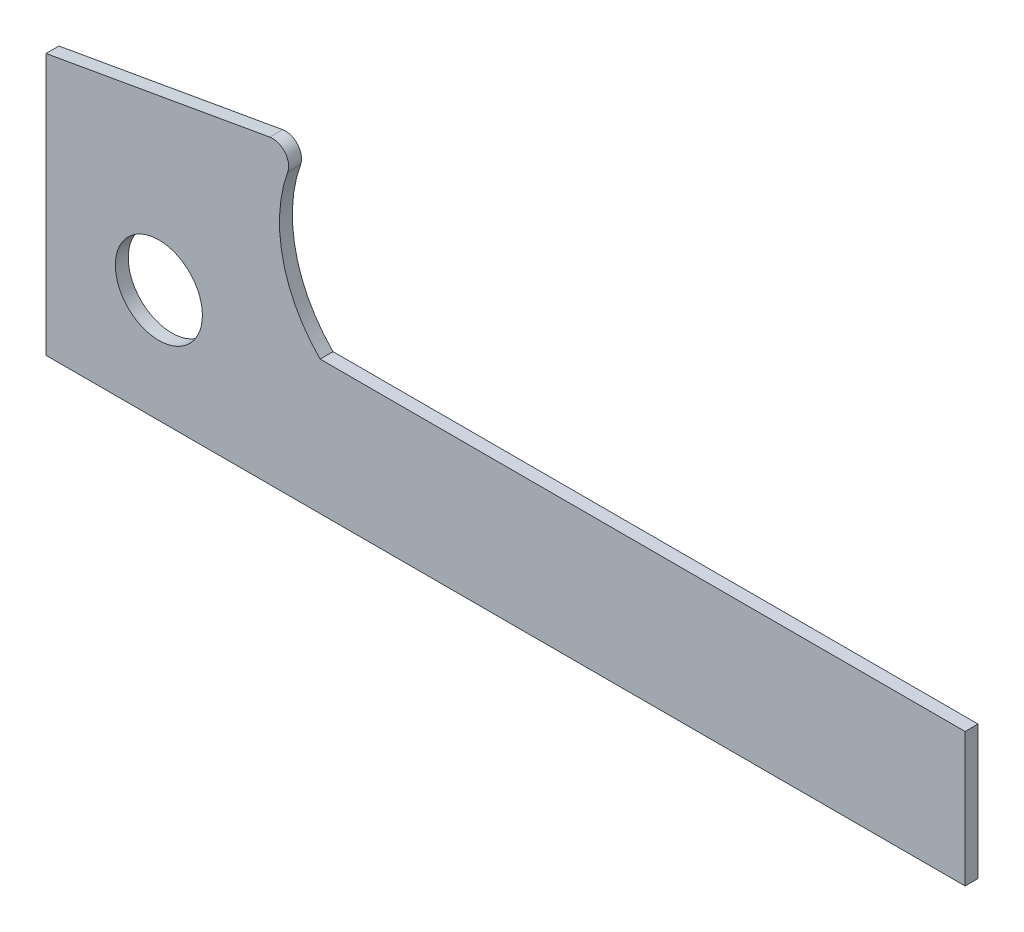
ISO-10303-21;
HEADER;
FILE_DESCRIPTION(('STEP AP214'),'2;1');
FILE_NAME('part.step','',(''),(''),'','','');
FILE_SCHEMA(('AUTOMOTIVE_DESIGN { 1 0 10303 214 1 1 1 1 }'));
ENDSEC;
DATA;
#1=APPLICATION_CONTEXT('core data for automotive mechanical design processes');
#2=APPLICATION_PROTOCOL_DEFINITION('international standard','automotive_design',2000,#1);
#3=PRODUCT_CONTEXT('',#1,'mechanical');
#4=PRODUCT('Part','Part','',(#3));
#5=PRODUCT_RELATED_PRODUCT_CATEGORY('part','',(#4));
#6=PRODUCT_DEFINITION_FORMATION('','',#4);
#7=PRODUCT_DEFINITION_CONTEXT('part definition',#1,'design');
#8=PRODUCT_DEFINITION('design','',#6,#7);
#9=PRODUCT_DEFINITION_SHAPE('','',#8);
#10=(LENGTH_UNIT() NAMED_UNIT(*) SI_UNIT(.MILLI.,.METRE.));
#11=(NAMED_UNIT(*) PLANE_ANGLE_UNIT() SI_UNIT($,.RADIAN.));
#12=(NAMED_UNIT(*) SI_UNIT($,.STERADIAN.) SOLID_ANGLE_UNIT());
#13=UNCERTAINTY_MEASURE_WITH_UNIT(LENGTH_MEASURE(1.E-05),#10,'distance_accuracy_value','');
#14=(GEOMETRIC_REPRESENTATION_CONTEXT(3) GLOBAL_UNCERTAINTY_ASSIGNED_CONTEXT((#13)) GLOBAL_UNIT_ASSIGNED_CONTEXT((#10,
#11,#12)) REPRESENTATION_CONTEXT('',''));
#15=CARTESIAN_POINT('',(0.,0.,0.));
#16=DIRECTION('',(0.,0.,1.));
#17=DIRECTION('',(1.,0.,0.));
#18=AXIS2_PLACEMENT_3D('',#15,#16,#17);
#19=CARTESIAN_POINT('',(-35.0000000000395,-35.,-4.));
#20=DIRECTION('',(-1.,0.,0.));
#21=DIRECTION('',(0.,0.,1.));
#22=AXIS2_PLACEMENT_3D('',#19,#20,#21);
#23=PLANE('',#22);
#24=DIRECTION('',(0.,-1.,0.));
#25=VECTOR('',#24,1.);
#26=CARTESIAN_POINT('',(-35.0000000000395,-35.,0.));
#27=LINE('',#26,#25);
#28=CARTESIAN_POINT('',(-35.0000000000395,46.0723593413953,0.));
#29=VERTEX_POINT('',#28);
#30=CARTESIAN_POINT('',(-35.0000000000395,-35.,0.));
#31=VERTEX_POINT('',#30);
#32=EDGE_CURVE('E142',#29,#31,#27,.T.);
#33=ORIENTED_EDGE('',*,*,#32,.F.);
#34=DIRECTION('',(0.,0.,1.));
#35=VECTOR('',#34,1.);
#36=CARTESIAN_POINT('',(-35.0000000000395,46.0723593413953,-4.));
#37=LINE('',#36,#35);
#38=CARTESIAN_POINT('',(-35.0000000000395,46.0723593413953,-4.));
#39=VERTEX_POINT('',#38);
#40=EDGE_CURVE('E49',#39,#29,#37,.T.);
#41=ORIENTED_EDGE('',*,*,#40,.F.);
#42=DIRECTION('',(0.,-1.,0.));
#43=VECTOR('',#42,1.);
#44=CARTESIAN_POINT('',(-35.0000000000395,-35.,-4.));
#45=LINE('',#44,#43);
#46=CARTESIAN_POINT('',(-35.0000000000395,-35.,-4.));
#47=VERTEX_POINT('',#46);
#48=EDGE_CURVE('E118',#39,#47,#45,.T.);
#49=ORIENTED_EDGE('',*,*,#48,.T.);
#50=DIRECTION('',(0.,0.,1.));
#51=VECTOR('',#50,1.);
#52=CARTESIAN_POINT('',(-35.0000000000395,-35.,-4.));
#53=LINE('',#52,#51);
#54=EDGE_CURVE('E11',#47,#31,#53,.T.);
#55=ORIENTED_EDGE('',*,*,#54,.T.);
#56=EDGE_LOOP('',(#33,#41,#49,#55));
#57=FACE_BOUND('',#56,.T.);
#58=ADVANCED_FACE('F39',(#57),#23,.T.);
#59=CARTESIAN_POINT('',(-35.0000000000395,46.0723593413953,-4.));
#60=DIRECTION('',(-0.173648177666927,0.984807753012209,0.));
#61=DIRECTION('',(-0.984807753012209,-0.173648177666927,0.));
#62=AXIS2_PLACEMENT_3D('',#59,#60,#61);
#63=PLANE('',#62);
#64=DIRECTION('',(-0.984807753012209,-0.173648177666927,0.));
#65=VECTOR('',#64,1.);
#66=CARTESIAN_POINT('',(-35.0000000000395,46.0723593413953,0.));
#67=LINE('',#66,#65);
#68=CARTESIAN_POINT('',(34.3750314435642,58.3050491724005,0.));
#69=VERTEX_POINT('',#68);
#70=EDGE_CURVE('E104',#69,#29,#67,.T.);
#71=ORIENTED_EDGE('',*,*,#70,.F.);
#72=DIRECTION('',(0.,0.,1.));
#73=VECTOR('',#72,1.);
#74=CARTESIAN_POINT('',(34.3750314435642,58.3050491724005,-4.));
#75=LINE('',#74,#73);
#76=CARTESIAN_POINT('',(34.3750314435642,58.3050491724005,-4.));
#77=VERTEX_POINT('',#76);
#78=EDGE_CURVE('E99',#77,#69,#75,.T.);
#79=ORIENTED_EDGE('',*,*,#78,.F.);
#80=DIRECTION('',(-0.984807753012209,-0.173648177666927,0.));
#81=VECTOR('',#80,1.);
#82=CARTESIAN_POINT('',(-35.0000000000395,46.0723593413953,-4.));
#83=LINE('',#82,#81);
#84=EDGE_CURVE('E102',#77,#39,#83,.T.);
#85=ORIENTED_EDGE('',*,*,#84,.T.);
#86=ORIENTED_EDGE('',*,*,#40,.T.);
#87=EDGE_LOOP('',(#71,#79,#85,#86));
#88=FACE_BOUND('',#87,.T.);
#89=ADVANCED_FACE('F101',(#88),#63,.T.);
#90=CARTESIAN_POINT('',(35.2432723318988,53.3810104073395,-4.));
#91=DIRECTION('',(0.,0.,1.));
#92=DIRECTION('',(1.,0.,0.));
#93=AXIS2_PLACEMENT_3D('',#90,#91,#92);
#94=CYLINDRICAL_SURFACE('',#93,5.00000000000001);
#95=CARTESIAN_POINT('',(35.2432723318988,53.3810104073395,0.));
#96=DIRECTION('',(0.,0.,1.));
#97=DIRECTION('',(1.,0.,0.));
#98=AXIS2_PLACEMENT_3D('',#95,#96,#97);
#99=CIRCLE('',#98,5.00000000000001);
#100=CARTESIAN_POINT('',(39.9479473239258,51.6880741358291,0.));
#101=VERTEX_POINT('',#100);
#102=EDGE_CURVE('E139',#101,#69,#99,.T.);
#103=ORIENTED_EDGE('',*,*,#102,.F.);
#104=DIRECTION('',(0.,0.,1.));
#105=VECTOR('',#104,1.);
#106=CARTESIAN_POINT('',(39.9479473239258,51.6880741358291,-4.));
#107=LINE('',#106,#105);
#108=CARTESIAN_POINT('',(39.9479473239258,51.6880741358291,-4.));
#109=VERTEX_POINT('',#108);
#110=EDGE_CURVE('E109',#109,#101,#107,.T.);
#111=ORIENTED_EDGE('',*,*,#110,.F.);
#112=CARTESIAN_POINT('',(35.2432723318988,53.3810104073395,-4.));
#113=DIRECTION('',(0.,0.,1.));
#114=DIRECTION('',(1.,0.,0.));
#115=AXIS2_PLACEMENT_3D('',#112,#113,#114);
#116=CIRCLE('',#115,5.00000000000001);
#117=EDGE_CURVE('E115',#109,#77,#116,.T.);
#118=ORIENTED_EDGE('',*,*,#117,.T.);
#119=ORIENTED_EDGE('',*,*,#78,.T.);
#120=EDGE_LOOP('',(#103,#111,#118,#119));
#121=FACE_BOUND('',#120,.T.);
#122=ADVANCED_FACE('F120',(#121),#94,.T.);
#123=CARTESIAN_POINT('',(80.670013107972,37.0345938564312,-4.));
#124=DIRECTION('',(0.,0.,1.));
#125=DIRECTION('',(1.,0.,0.));
#126=AXIS2_PLACEMENT_3D('',#123,#124,#125);
#127=CYLINDRICAL_SURFACE('',#126,43.2782985573473);
#128=CARTESIAN_POINT('',(80.670013107972,37.0345938564312,0.));
#129=DIRECTION('',(0.,0.,-1.));
#130=DIRECTION('',(-1.,0.,0.));
#131=AXIS2_PLACEMENT_3D('',#128,#129,#130);
#132=CIRCLE('',#131,43.2782985573473);
#133=CARTESIAN_POINT('',(50.,6.5000000000245,0.));
#134=VERTEX_POINT('',#133);
#135=EDGE_CURVE('E136',#134,#101,#132,.T.);
#136=ORIENTED_EDGE('',*,*,#135,.F.);
#137=DIRECTION('',(0.,0.,1.));
#138=VECTOR('',#137,1.);
#139=CARTESIAN_POINT('',(50.,6.5000000000245,-4.));
#140=LINE('',#139,#138);
#141=CARTESIAN_POINT('',(50.,6.5000000000245,-4.));
#142=VERTEX_POINT('',#141);
#143=EDGE_CURVE('E147',#142,#134,#140,.T.);
#144=ORIENTED_EDGE('',*,*,#143,.F.);
#145=CARTESIAN_POINT('',(80.670013107972,37.0345938564312,-4.));
#146=DIRECTION('',(0.,0.,-1.));
#147=DIRECTION('',(-1.,0.,0.));
#148=AXIS2_PLACEMENT_3D('',#145,#146,#147);
#149=CIRCLE('',#148,43.2782985573473);
#150=EDGE_CURVE('E121',#142,#109,#149,.T.);
#151=ORIENTED_EDGE('',*,*,#150,.T.);
#152=ORIENTED_EDGE('',*,*,#110,.T.);
#153=EDGE_LOOP('',(#136,#144,#151,#152));
#154=FACE_BOUND('',#153,.T.);
#155=ADVANCED_FACE('F170',(#154),#127,.F.);
#156=CARTESIAN_POINT('',(50.,6.50000000002451,-4.));
#157=DIRECTION('',(0.,1.,0.));
#158=DIRECTION('',(-1.,0.,0.));
#159=AXIS2_PLACEMENT_3D('',#156,#157,#158);
#160=PLANE('',#159);
#161=DIRECTION('',(-1.,0.,0.));
#162=VECTOR('',#161,1.);
#163=CARTESIAN_POINT('',(50.,6.50000000002451,0.));
#164=LINE('',#163,#162);
#165=CARTESIAN_POINT('',(250.,6.50000000002454,0.));
#166=VERTEX_POINT('',#165);
#167=EDGE_CURVE('E133',#166,#134,#164,.T.);
#168=ORIENTED_EDGE('',*,*,#167,.F.);
#169=DIRECTION('',(0.,0.,1.));
#170=VECTOR('',#169,1.);
#171=CARTESIAN_POINT('',(250.,6.50000000002454,-4.));
#172=LINE('',#171,#170);
#173=CARTESIAN_POINT('',(250.,6.50000000002454,-4.));
#174=VERTEX_POINT('',#173);
#175=EDGE_CURVE('E148',#174,#166,#172,.T.);
#176=ORIENTED_EDGE('',*,*,#175,.F.);
#177=DIRECTION('',(-1.,0.,0.));
#178=VECTOR('',#177,1.);
#179=CARTESIAN_POINT('',(50.,6.50000000002451,-4.));
#180=LINE('',#179,#178);
#181=EDGE_CURVE('E123',#174,#142,#180,.T.);
#182=ORIENTED_EDGE('',*,*,#181,.T.);
#183=ORIENTED_EDGE('',*,*,#143,.T.);
#184=EDGE_LOOP('',(#168,#176,#182,#183));
#185=FACE_BOUND('',#184,.T.);
#186=ADVANCED_FACE('F173',(#185),#160,.T.);
#187=CARTESIAN_POINT('',(250.,-35.,-4.));
#188=DIRECTION('',(1.,0.,0.));
#189=DIRECTION('',(0.,1.,0.));
#190=AXIS2_PLACEMENT_3D('',#187,#188,#189);
#191=PLANE('',#190);
#192=DIRECTION('',(0.,1.,0.));
#193=VECTOR('',#192,1.);
#194=CARTESIAN_POINT('',(250.,-35.,0.));
#195=LINE('',#194,#193);
#196=CARTESIAN_POINT('',(250.,-35.,0.));
#197=VERTEX_POINT('',#196);
#198=EDGE_CURVE('E129',#197,#166,#195,.T.);
#199=ORIENTED_EDGE('',*,*,#198,.F.);
#200=DIRECTION('',(0.,0.,1.));
#201=VECTOR('',#200,1.);
#202=CARTESIAN_POINT('',(250.,-35.,-4.));
#203=LINE('',#202,#201);
#204=CARTESIAN_POINT('',(250.,-35.,-4.));
#205=VERTEX_POINT('',#204);
#206=EDGE_CURVE('E43',#205,#197,#203,.T.);
#207=ORIENTED_EDGE('',*,*,#206,.F.);
#208=DIRECTION('',(0.,1.,0.));
#209=VECTOR('',#208,1.);
#210=CARTESIAN_POINT('',(250.,-35.,-4.));
#211=LINE('',#210,#209);
#212=EDGE_CURVE('E205',#205,#174,#211,.T.);
#213=ORIENTED_EDGE('',*,*,#212,.T.);
#214=ORIENTED_EDGE('',*,*,#175,.T.);
#215=EDGE_LOOP('',(#199,#207,#213,#214));
#216=FACE_BOUND('',#215,.T.);
#217=ADVANCED_FACE('F154',(#216),#191,.T.);
#218=CARTESIAN_POINT('',(0.,-35.,-4.));
#219=DIRECTION('',(0.,-1.,0.));
#220=DIRECTION('',(1.,0.,0.));
#221=AXIS2_PLACEMENT_3D('',#218,#219,#220);
#222=PLANE('',#221);
#223=DIRECTION('',(1.,0.,0.));
#224=VECTOR('',#223,1.);
#225=CARTESIAN_POINT('',(0.,-35.,0.));
#226=LINE('',#225,#224);
#227=EDGE_CURVE('E85',#31,#197,#226,.T.);
#228=ORIENTED_EDGE('',*,*,#227,.F.);
#229=ORIENTED_EDGE('',*,*,#54,.F.);
#230=DIRECTION('',(1.,0.,0.));
#231=VECTOR('',#230,1.);
#232=CARTESIAN_POINT('',(-35.0000000000395,-35.,-4.));
#233=LINE('',#232,#231);
#234=EDGE_CURVE('E88',#47,#205,#233,.T.);
#235=ORIENTED_EDGE('',*,*,#234,.T.);
#236=ORIENTED_EDGE('',*,*,#206,.T.);
#237=EDGE_LOOP('',(#228,#229,#235,#236));
#238=FACE_BOUND('',#237,.T.);
#239=ADVANCED_FACE('F41',(#238),#222,.T.);
#240=CARTESIAN_POINT('',(80.670013107972,37.0345938564312,-4.));
#241=DIRECTION('',(0.,0.,-1.));
#242=DIRECTION('',(-1.,0.,0.));
#243=AXIS2_PLACEMENT_3D('',#240,#241,#242);
#244=PLANE('',#243);
#245=CARTESIAN_POINT('',(-3.94961841010399E-11,-2.56739074444567E-11,-4.));
#246=DIRECTION('',(0.,0.,1.));
#247=DIRECTION('',(1.,0.,0.));
#248=AXIS2_PLACEMENT_3D('',#245,#246,#247);
#249=CIRCLE('',#248,13.5);
#250=CARTESIAN_POINT('',(13.4999999999605,-2.56739074444567E-11,-4.));
#251=VERTEX_POINT('',#250);
#252=EDGE_CURVE('E130',#251,#251,#249,.T.);
#253=ORIENTED_EDGE('',*,*,#252,.T.);
#254=EDGE_LOOP('',(#253));
#255=FACE_BOUND('',#254,.T.);
#256=ORIENTED_EDGE('',*,*,#234,.F.);
#257=ORIENTED_EDGE('',*,*,#48,.F.);
#258=ORIENTED_EDGE('',*,*,#84,.F.);
#259=ORIENTED_EDGE('',*,*,#117,.F.);
#260=ORIENTED_EDGE('',*,*,#150,.F.);
#261=ORIENTED_EDGE('',*,*,#181,.F.);
#262=ORIENTED_EDGE('',*,*,#212,.F.);
#263=EDGE_LOOP('',(#256,#257,#258,#259,#260,#261,#262));
#264=FACE_BOUND('',#263,.T.);
#265=ADVANCED_FACE('F113',(#255,#264),#244,.T.);
#266=CARTESIAN_POINT('',(80.670013107972,37.0345938564312,0.));
#267=DIRECTION('',(0.,0.,-1.));
#268=DIRECTION('',(-1.,0.,0.));
#269=AXIS2_PLACEMENT_3D('',#266,#267,#268);
#270=PLANE('',#269);
#271=CARTESIAN_POINT('',(-3.94961841010399E-11,-2.56739074444567E-11,0.));
#272=DIRECTION('',(0.,0.,1.));
#273=DIRECTION('',(1.,0.,0.));
#274=AXIS2_PLACEMENT_3D('',#271,#272,#273);
#275=CIRCLE('',#274,13.5);
#276=CARTESIAN_POINT('',(13.4999999999605,-2.56739074444567E-11,0.));
#277=VERTEX_POINT('',#276);
#278=EDGE_CURVE('E200',#277,#277,#275,.T.);
#279=ORIENTED_EDGE('',*,*,#278,.F.);
#280=EDGE_LOOP('',(#279));
#281=FACE_BOUND('',#280,.T.);
#282=ORIENTED_EDGE('',*,*,#32,.T.);
#283=ORIENTED_EDGE('',*,*,#227,.T.);
#284=ORIENTED_EDGE('',*,*,#198,.T.);
#285=ORIENTED_EDGE('',*,*,#167,.T.);
#286=ORIENTED_EDGE('',*,*,#135,.T.);
#287=ORIENTED_EDGE('',*,*,#102,.T.);
#288=ORIENTED_EDGE('',*,*,#70,.T.);
#289=EDGE_LOOP('',(#282,#283,#284,#285,#286,#287,#288));
#290=FACE_BOUND('',#289,.T.);
#291=ADVANCED_FACE('F156',(#281,#290),#270,.F.);
#292=CARTESIAN_POINT('',(-3.94961841010399E-11,-2.56739074444567E-11,-4.));
#293=DIRECTION('',(0.,0.,1.));
#294=DIRECTION('',(1.,0.,0.));
#295=AXIS2_PLACEMENT_3D('',#292,#293,#294);
#296=CYLINDRICAL_SURFACE('',#295,13.5);
#297=ORIENTED_EDGE('',*,*,#252,.F.);
#298=EDGE_LOOP('',(#297));
#299=FACE_BOUND('',#298,.T.);
#300=ORIENTED_EDGE('',*,*,#278,.T.);
#301=EDGE_LOOP('',(#300));
#302=FACE_BOUND('',#301,.T.);
#303=ADVANCED_FACE('F188',(#299,#302),#296,.F.);
#304=CLOSED_SHELL('',(#58,#89,#122,#155,#186,#217,#239,#265,#291,#303));
#305=MANIFOLD_SOLID_BREP('B2',#304);
#306=ADVANCED_BREP_SHAPE_REPRESENTATION('',(#18,#305),#14);
#307=SHAPE_DEFINITION_REPRESENTATION(#9,#306);
ENDSEC;
END-ISO-10303-21;
